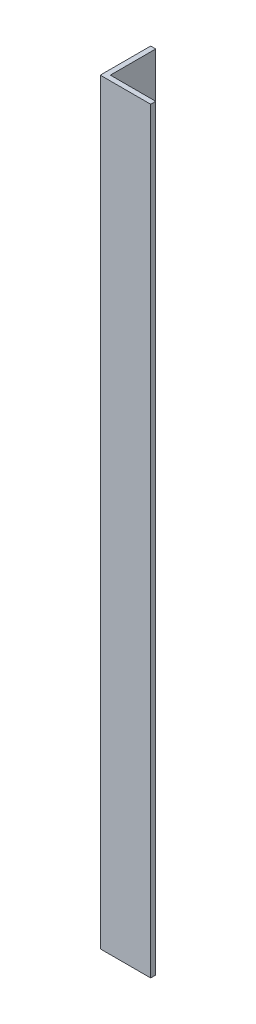
ISO-10303-21;
HEADER;
FILE_DESCRIPTION(('STEP AP214'),'2;1');
FILE_NAME('part.step','',(''),(''),'','','');
FILE_SCHEMA(('AUTOMOTIVE_DESIGN { 1 0 10303 214 1 1 1 1 }'));
ENDSEC;
DATA;
#1=APPLICATION_CONTEXT('core data for automotive mechanical design processes');
#2=APPLICATION_PROTOCOL_DEFINITION('international standard','automotive_design',2000,#1);
#3=PRODUCT_CONTEXT('',#1,'mechanical');
#4=PRODUCT('Part','Part','',(#3));
#5=PRODUCT_RELATED_PRODUCT_CATEGORY('part','',(#4));
#6=PRODUCT_DEFINITION_FORMATION('','',#4);
#7=PRODUCT_DEFINITION_CONTEXT('part definition',#1,'design');
#8=PRODUCT_DEFINITION('design','',#6,#7);
#9=PRODUCT_DEFINITION_SHAPE('','',#8);
#10=(LENGTH_UNIT() NAMED_UNIT(*) SI_UNIT(.MILLI.,.METRE.));
#11=(NAMED_UNIT(*) PLANE_ANGLE_UNIT() SI_UNIT($,.RADIAN.));
#12=(NAMED_UNIT(*) SI_UNIT($,.STERADIAN.) SOLID_ANGLE_UNIT());
#13=UNCERTAINTY_MEASURE_WITH_UNIT(LENGTH_MEASURE(1.E-05),#10,'distance_accuracy_value','');
#14=(GEOMETRIC_REPRESENTATION_CONTEXT(3) GLOBAL_UNCERTAINTY_ASSIGNED_CONTEXT((#13)) GLOBAL_UNIT_ASSIGNED_CONTEXT((#10,
#11,#12)) REPRESENTATION_CONTEXT('',''));
#15=CARTESIAN_POINT('',(0.,0.,0.));
#16=DIRECTION('',(0.,0.,1.));
#17=DIRECTION('',(1.,0.,0.));
#18=AXIS2_PLACEMENT_3D('',#15,#16,#17);
#19=CARTESIAN_POINT('',(0.,600.,0.));
#20=DIRECTION('',(0.,0.,-1.));
#21=DIRECTION('',(-1.,0.,0.));
#22=AXIS2_PLACEMENT_3D('',#19,#20,#21);
#23=PLANE('',#22);
#24=DIRECTION('',(1.,0.,0.));
#25=VECTOR('',#24,1.);
#26=CARTESIAN_POINT('',(0.,0.,0.));
#27=LINE('',#26,#25);
#28=CARTESIAN_POINT('',(0.,0.,0.));
#29=VERTEX_POINT('',#28);
#30=CARTESIAN_POINT('',(40.,0.,0.));
#31=VERTEX_POINT('',#30);
#32=EDGE_CURVE('E116',#29,#31,#27,.T.);
#33=ORIENTED_EDGE('',*,*,#32,.T.);
#34=DIRECTION('',(0.,-1.,0.));
#35=VECTOR('',#34,1.);
#36=CARTESIAN_POINT('',(40.,600.,0.));
#37=LINE('',#36,#35);
#38=CARTESIAN_POINT('',(40.,600.,0.));
#39=VERTEX_POINT('',#38);
#40=EDGE_CURVE('E11',#39,#31,#37,.T.);
#41=ORIENTED_EDGE('',*,*,#40,.F.);
#42=DIRECTION('',(1.,0.,0.));
#43=VECTOR('',#42,1.);
#44=CARTESIAN_POINT('',(0.,600.,0.));
#45=LINE('',#44,#43);
#46=CARTESIAN_POINT('',(0.,600.,0.));
#47=VERTEX_POINT('',#46);
#48=EDGE_CURVE('E81',#47,#39,#45,.T.);
#49=ORIENTED_EDGE('',*,*,#48,.F.);
#50=DIRECTION('',(0.,-1.,0.));
#51=VECTOR('',#50,1.);
#52=CARTESIAN_POINT('',(0.,600.,0.));
#53=LINE('',#52,#51);
#54=EDGE_CURVE('E112',#47,#29,#53,.T.);
#55=ORIENTED_EDGE('',*,*,#54,.T.);
#56=EDGE_LOOP('',(#33,#41,#49,#55));
#57=FACE_BOUND('',#56,.T.);
#58=ADVANCED_FACE('F35',(#57),#23,.F.);
#59=CARTESIAN_POINT('',(40.,600.,-4.));
#60=DIRECTION('',(1.,0.,0.));
#61=DIRECTION('',(0.,0.,-1.));
#62=AXIS2_PLACEMENT_3D('',#59,#60,#61);
#63=PLANE('',#62);
#64=DIRECTION('',(0.,0.,1.));
#65=VECTOR('',#64,1.);
#66=CARTESIAN_POINT('',(40.,0.,-4.));
#67=LINE('',#66,#65);
#68=CARTESIAN_POINT('',(40.,0.,-4.));
#69=VERTEX_POINT('',#68);
#70=EDGE_CURVE('E119',#69,#31,#67,.T.);
#71=ORIENTED_EDGE('',*,*,#70,.F.);
#72=DIRECTION('',(0.,-1.,0.));
#73=VECTOR('',#72,1.);
#74=CARTESIAN_POINT('',(40.,600.,-4.));
#75=LINE('',#74,#73);
#76=CARTESIAN_POINT('',(40.,600.,-4.));
#77=VERTEX_POINT('',#76);
#78=EDGE_CURVE('E43',#77,#69,#75,.T.);
#79=ORIENTED_EDGE('',*,*,#78,.F.);
#80=DIRECTION('',(0.,0.,1.));
#81=VECTOR('',#80,1.);
#82=CARTESIAN_POINT('',(40.,600.,-4.));
#83=LINE('',#82,#81);
#84=EDGE_CURVE('E205',#77,#39,#83,.T.);
#85=ORIENTED_EDGE('',*,*,#84,.T.);
#86=ORIENTED_EDGE('',*,*,#40,.T.);
#87=EDGE_LOOP('',(#71,#79,#85,#86));
#88=FACE_BOUND('',#87,.T.);
#89=ADVANCED_FACE('F137',(#88),#63,.T.);
#90=CARTESIAN_POINT('',(0.,600.,-4.));
#91=DIRECTION('',(0.,0.,-1.));
#92=DIRECTION('',(-1.,0.,0.));
#93=AXIS2_PLACEMENT_3D('',#90,#91,#92);
#94=PLANE('',#93);
#95=DIRECTION('',(1.,0.,0.));
#96=VECTOR('',#95,1.);
#97=CARTESIAN_POINT('',(0.,0.,-4.));
#98=LINE('',#97,#96);
#99=CARTESIAN_POINT('',(4.,0.,-4.));
#100=VERTEX_POINT('',#99);
#101=EDGE_CURVE('E122',#100,#69,#98,.T.);
#102=ORIENTED_EDGE('',*,*,#101,.F.);
#103=DIRECTION('',(0.,-1.,0.));
#104=VECTOR('',#103,1.);
#105=CARTESIAN_POINT('',(4.,600.,-4.));
#106=LINE('',#105,#104);
#107=CARTESIAN_POINT('',(4.,600.,-4.));
#108=VERTEX_POINT('',#107);
#109=EDGE_CURVE('E102',#108,#100,#106,.T.);
#110=ORIENTED_EDGE('',*,*,#109,.F.);
#111=DIRECTION('',(1.,0.,0.));
#112=VECTOR('',#111,1.);
#113=CARTESIAN_POINT('',(0.,600.,-4.));
#114=LINE('',#113,#112);
#115=EDGE_CURVE('E108',#108,#77,#114,.T.);
#116=ORIENTED_EDGE('',*,*,#115,.T.);
#117=ORIENTED_EDGE('',*,*,#78,.T.);
#118=EDGE_LOOP('',(#102,#110,#116,#117));
#119=FACE_BOUND('',#118,.T.);
#120=ADVANCED_FACE('F134',(#119),#94,.T.);
#121=CARTESIAN_POINT('',(4.,600.,-40.));
#122=DIRECTION('',(1.,0.,0.));
#123=DIRECTION('',(0.,0.,-1.));
#124=AXIS2_PLACEMENT_3D('',#121,#122,#123);
#125=PLANE('',#124);
#126=DIRECTION('',(0.,0.,1.));
#127=VECTOR('',#126,1.);
#128=CARTESIAN_POINT('',(4.,0.,-40.));
#129=LINE('',#128,#127);
#130=CARTESIAN_POINT('',(4.,0.,-40.));
#131=VERTEX_POINT('',#130);
#132=EDGE_CURVE('E97',#131,#100,#129,.T.);
#133=ORIENTED_EDGE('',*,*,#132,.F.);
#134=DIRECTION('',(0.,-1.,0.));
#135=VECTOR('',#134,1.);
#136=CARTESIAN_POINT('',(4.,600.,-40.));
#137=LINE('',#136,#135);
#138=CARTESIAN_POINT('',(4.,600.,-40.));
#139=VERTEX_POINT('',#138);
#140=EDGE_CURVE('E92',#139,#131,#137,.T.);
#141=ORIENTED_EDGE('',*,*,#140,.F.);
#142=DIRECTION('',(0.,0.,1.));
#143=VECTOR('',#142,1.);
#144=CARTESIAN_POINT('',(4.,600.,-40.));
#145=LINE('',#144,#143);
#146=EDGE_CURVE('E95',#139,#108,#145,.T.);
#147=ORIENTED_EDGE('',*,*,#146,.T.);
#148=ORIENTED_EDGE('',*,*,#109,.T.);
#149=EDGE_LOOP('',(#133,#141,#147,#148));
#150=FACE_BOUND('',#149,.T.);
#151=ADVANCED_FACE('F94',(#150),#125,.T.);
#152=CARTESIAN_POINT('',(0.,600.,-40.));
#153=DIRECTION('',(0.,0.,-1.));
#154=DIRECTION('',(-1.,0.,0.));
#155=AXIS2_PLACEMENT_3D('',#152,#153,#154);
#156=PLANE('',#155);
#157=DIRECTION('',(1.,0.,0.));
#158=VECTOR('',#157,1.);
#159=CARTESIAN_POINT('',(0.,0.,-40.));
#160=LINE('',#159,#158);
#161=CARTESIAN_POINT('',(0.,0.,-40.));
#162=VERTEX_POINT('',#161);
#163=EDGE_CURVE('E126',#162,#131,#160,.T.);
#164=ORIENTED_EDGE('',*,*,#163,.F.);
#165=DIRECTION('',(0.,-1.,0.));
#166=VECTOR('',#165,1.);
#167=CARTESIAN_POINT('',(0.,600.,-40.));
#168=LINE('',#167,#166);
#169=CARTESIAN_POINT('',(0.,600.,-40.));
#170=VERTEX_POINT('',#169);
#171=EDGE_CURVE('E72',#170,#162,#168,.T.);
#172=ORIENTED_EDGE('',*,*,#171,.F.);
#173=DIRECTION('',(1.,0.,0.));
#174=VECTOR('',#173,1.);
#175=CARTESIAN_POINT('',(0.,600.,-40.));
#176=LINE('',#175,#174);
#177=EDGE_CURVE('E106',#170,#139,#176,.T.);
#178=ORIENTED_EDGE('',*,*,#177,.T.);
#179=ORIENTED_EDGE('',*,*,#140,.T.);
#180=EDGE_LOOP('',(#164,#172,#178,#179));
#181=FACE_BOUND('',#180,.T.);
#182=ADVANCED_FACE('F110',(#181),#156,.T.);
#183=CARTESIAN_POINT('',(0.,600.,-40.));
#184=DIRECTION('',(1.,0.,0.));
#185=DIRECTION('',(0.,0.,-1.));
#186=AXIS2_PLACEMENT_3D('',#183,#184,#185);
#187=PLANE('',#186);
#188=DIRECTION('',(0.,0.,1.));
#189=VECTOR('',#188,1.);
#190=CARTESIAN_POINT('',(0.,0.,-40.));
#191=LINE('',#190,#189);
#192=EDGE_CURVE('E75',#162,#29,#191,.T.);
#193=ORIENTED_EDGE('',*,*,#192,.T.);
#194=ORIENTED_EDGE('',*,*,#54,.F.);
#195=DIRECTION('',(0.,0.,1.));
#196=VECTOR('',#195,1.);
#197=CARTESIAN_POINT('',(0.,600.,-40.));
#198=LINE('',#197,#196);
#199=EDGE_CURVE('E51',#170,#47,#198,.T.);
#200=ORIENTED_EDGE('',*,*,#199,.F.);
#201=ORIENTED_EDGE('',*,*,#171,.T.);
#202=EDGE_LOOP('',(#193,#194,#200,#201));
#203=FACE_BOUND('',#202,.T.);
#204=ADVANCED_FACE('F142',(#203),#187,.F.);
#205=CARTESIAN_POINT('',(0.,600.,0.));
#206=DIRECTION('',(0.,-1.,0.));
#207=DIRECTION('',(-1.,0.,0.));
#208=AXIS2_PLACEMENT_3D('',#205,#206,#207);
#209=PLANE('',#208);
#210=ORIENTED_EDGE('',*,*,#48,.T.);
#211=ORIENTED_EDGE('',*,*,#84,.F.);
#212=ORIENTED_EDGE('',*,*,#115,.F.);
#213=ORIENTED_EDGE('',*,*,#146,.F.);
#214=ORIENTED_EDGE('',*,*,#177,.F.);
#215=ORIENTED_EDGE('',*,*,#199,.T.);
#216=EDGE_LOOP('',(#210,#211,#212,#213,#214,#215));
#217=FACE_BOUND('',#216,.T.);
#218=ADVANCED_FACE('F105',(#217),#209,.F.);
#219=CARTESIAN_POINT('',(0.,0.,0.));
#220=DIRECTION('',(0.,-1.,0.));
#221=DIRECTION('',(-1.,0.,0.));
#222=AXIS2_PLACEMENT_3D('',#219,#220,#221);
#223=PLANE('',#222);
#224=ORIENTED_EDGE('',*,*,#32,.F.);
#225=ORIENTED_EDGE('',*,*,#192,.F.);
#226=ORIENTED_EDGE('',*,*,#163,.T.);
#227=ORIENTED_EDGE('',*,*,#132,.T.);
#228=ORIENTED_EDGE('',*,*,#101,.T.);
#229=ORIENTED_EDGE('',*,*,#70,.T.);
#230=EDGE_LOOP('',(#224,#225,#226,#227,#228,#229));
#231=FACE_BOUND('',#230,.T.);
#232=ADVANCED_FACE('F140',(#231),#223,.T.);
#233=CLOSED_SHELL('',(#58,#89,#120,#151,#182,#204,#218,#232));
#234=MANIFOLD_SOLID_BREP('B2',#233);
#235=ADVANCED_BREP_SHAPE_REPRESENTATION('',(#18,#234),#14);
#236=SHAPE_DEFINITION_REPRESENTATION(#9,#235);
ENDSEC;
END-ISO-10303-21;
